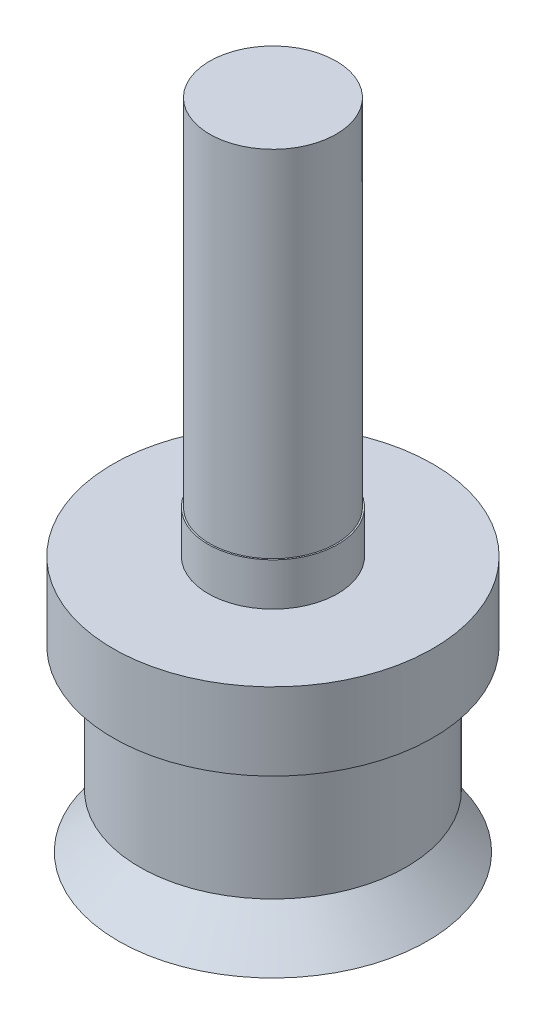
ISO-10303-21;
HEADER;
FILE_DESCRIPTION(('STEP AP214'),'2;1');
FILE_NAME('part.step','',(''),(''),'','','');
FILE_SCHEMA(('AUTOMOTIVE_DESIGN { 1 0 10303 214 1 1 1 1 }'));
ENDSEC;
DATA;
#1=APPLICATION_CONTEXT('core data for automotive mechanical design processes');
#2=APPLICATION_PROTOCOL_DEFINITION('international standard','automotive_design',2000,#1);
#3=PRODUCT_CONTEXT('',#1,'mechanical');
#4=PRODUCT('Part','Part','',(#3));
#5=PRODUCT_RELATED_PRODUCT_CATEGORY('part','',(#4));
#6=PRODUCT_DEFINITION_FORMATION('','',#4);
#7=PRODUCT_DEFINITION_CONTEXT('part definition',#1,'design');
#8=PRODUCT_DEFINITION('design','',#6,#7);
#9=PRODUCT_DEFINITION_SHAPE('','',#8);
#10=(LENGTH_UNIT() NAMED_UNIT(*) SI_UNIT(.MILLI.,.METRE.));
#11=(NAMED_UNIT(*) PLANE_ANGLE_UNIT() SI_UNIT($,.RADIAN.));
#12=(NAMED_UNIT(*) SI_UNIT($,.STERADIAN.) SOLID_ANGLE_UNIT());
#13=UNCERTAINTY_MEASURE_WITH_UNIT(LENGTH_MEASURE(1.E-05),#10,'distance_accuracy_value','');
#14=(GEOMETRIC_REPRESENTATION_CONTEXT(3) GLOBAL_UNCERTAINTY_ASSIGNED_CONTEXT((#13)) GLOBAL_UNIT_ASSIGNED_CONTEXT((#10,
#11,#12)) REPRESENTATION_CONTEXT('',''));
#15=CARTESIAN_POINT('',(0.,0.,0.));
#16=DIRECTION('',(0.,0.,1.));
#17=DIRECTION('',(1.,0.,0.));
#18=AXIS2_PLACEMENT_3D('',#15,#16,#17);
#19=CARTESIAN_POINT('',(0.,14.9,0.));
#20=DIRECTION('',(0.,-1.,0.));
#21=DIRECTION('',(0.,0.,-1.));
#22=AXIS2_PLACEMENT_3D('',#19,#20,#21);
#23=PLANE('',#22);
#24=CARTESIAN_POINT('',(0.,14.9,0.));
#25=DIRECTION('',(0.,-1.,0.));
#26=DIRECTION('',(0.,0.,-1.));
#27=AXIS2_PLACEMENT_3D('',#24,#25,#26);
#28=CIRCLE('',#27,2.375);
#29=CARTESIAN_POINT('',(0.,14.9,-2.375));
#30=VERTEX_POINT('',#29);
#31=EDGE_CURVE('E10',#30,#30,#28,.T.);
#32=ORIENTED_EDGE('',*,*,#31,.F.);
#33=EDGE_LOOP('',(#32));
#34=FACE_BOUND('',#33,.T.);
#35=ADVANCED_FACE('F37',(#34),#23,.F.);
#36=CARTESIAN_POINT('',(0.,-18.1189606466658,0.));
#37=DIRECTION('',(0.,-1.,0.));
#38=DIRECTION('',(0.,0.,-1.));
#39=AXIS2_PLACEMENT_3D('',#36,#37,#38);
#40=CYLINDRICAL_SURFACE('',#39,2.375);
#41=CARTESIAN_POINT('',(0.,1.6,0.));
#42=DIRECTION('',(0.,-1.,0.));
#43=DIRECTION('',(0.,0.,-1.));
#44=AXIS2_PLACEMENT_3D('',#41,#42,#43);
#45=CIRCLE('',#44,2.375);
#46=CARTESIAN_POINT('',(0.,1.6,-2.375));
#47=VERTEX_POINT('',#46);
#48=EDGE_CURVE('E44',#47,#47,#45,.T.);
#49=ORIENTED_EDGE('',*,*,#48,.F.);
#50=EDGE_LOOP('',(#49));
#51=FACE_BOUND('',#50,.T.);
#52=ORIENTED_EDGE('',*,*,#31,.T.);
#53=EDGE_LOOP('',(#52));
#54=FACE_BOUND('',#53,.T.);
#55=ADVANCED_FACE('F151',(#51,#54),#40,.T.);
#56=CARTESIAN_POINT('',(-2.375,1.6,0.));
#57=DIRECTION('',(0.,-1.,0.));
#58=DIRECTION('',(0.,0.,-1.));
#59=AXIS2_PLACEMENT_3D('',#56,#57,#58);
#60=PLANE('',#59);
#61=CARTESIAN_POINT('',(0.,1.6,0.));
#62=DIRECTION('',(0.,-1.,0.));
#63=DIRECTION('',(0.,0.,-1.));
#64=AXIS2_PLACEMENT_3D('',#61,#62,#63);
#65=CIRCLE('',#64,2.43);
#66=CARTESIAN_POINT('',(0.,1.6,-2.43));
#67=VERTEX_POINT('',#66);
#68=EDGE_CURVE('E49',#67,#67,#65,.T.);
#69=ORIENTED_EDGE('',*,*,#68,.F.);
#70=EDGE_LOOP('',(#69));
#71=FACE_BOUND('',#70,.T.);
#72=ORIENTED_EDGE('',*,*,#48,.T.);
#73=EDGE_LOOP('',(#72));
#74=FACE_BOUND('',#73,.T.);
#75=ADVANCED_FACE('F146',(#71,#74),#60,.F.);
#76=CARTESIAN_POINT('',(0.,-18.1189606466658,0.));
#77=DIRECTION('',(0.,-1.,0.));
#78=DIRECTION('',(0.,0.,-1.));
#79=AXIS2_PLACEMENT_3D('',#76,#77,#78);
#80=CYLINDRICAL_SURFACE('',#79,2.43);
#81=CARTESIAN_POINT('',(0.,0.,0.));
#82=DIRECTION('',(0.,-1.,0.));
#83=DIRECTION('',(0.,0.,-1.));
#84=AXIS2_PLACEMENT_3D('',#81,#82,#83);
#85=CIRCLE('',#84,2.43);
#86=CARTESIAN_POINT('',(0.,0.,-2.43));
#87=VERTEX_POINT('',#86);
#88=EDGE_CURVE('E54',#87,#87,#85,.T.);
#89=ORIENTED_EDGE('',*,*,#88,.F.);
#90=EDGE_LOOP('',(#89));
#91=FACE_BOUND('',#90,.T.);
#92=ORIENTED_EDGE('',*,*,#68,.T.);
#93=EDGE_LOOP('',(#92));
#94=FACE_BOUND('',#93,.T.);
#95=ADVANCED_FACE('F140',(#91,#94),#80,.T.);
#96=CARTESIAN_POINT('',(-2.43,0.,0.));
#97=DIRECTION('',(0.,-1.,0.));
#98=DIRECTION('',(0.,0.,-1.));
#99=AXIS2_PLACEMENT_3D('',#96,#97,#98);
#100=PLANE('',#99);
#101=CARTESIAN_POINT('',(0.,0.,0.));
#102=DIRECTION('',(0.,-1.,0.));
#103=DIRECTION('',(0.,0.,-1.));
#104=AXIS2_PLACEMENT_3D('',#101,#102,#103);
#105=CIRCLE('',#104,6.);
#106=CARTESIAN_POINT('',(0.,0.,-6.));
#107=VERTEX_POINT('',#106);
#108=EDGE_CURVE('E60',#107,#107,#105,.T.);
#109=ORIENTED_EDGE('',*,*,#108,.F.);
#110=EDGE_LOOP('',(#109));
#111=FACE_BOUND('',#110,.T.);
#112=ORIENTED_EDGE('',*,*,#88,.T.);
#113=EDGE_LOOP('',(#112));
#114=FACE_BOUND('',#113,.T.);
#115=ADVANCED_FACE('F134',(#111,#114),#100,.F.);
#116=CARTESIAN_POINT('',(0.,-18.1189606466658,0.));
#117=DIRECTION('',(0.,-1.,0.));
#118=DIRECTION('',(0.,0.,-1.));
#119=AXIS2_PLACEMENT_3D('',#116,#117,#118);
#120=CYLINDRICAL_SURFACE('',#119,6.);
#121=CARTESIAN_POINT('',(0.,-2.9,0.));
#122=DIRECTION('',(0.,-1.,0.));
#123=DIRECTION('',(0.,0.,-1.));
#124=AXIS2_PLACEMENT_3D('',#121,#122,#123);
#125=CIRCLE('',#124,6.);
#126=CARTESIAN_POINT('',(0.,-2.9,-6.));
#127=VERTEX_POINT('',#126);
#128=EDGE_CURVE('E64',#127,#127,#125,.T.);
#129=ORIENTED_EDGE('',*,*,#128,.F.);
#130=EDGE_LOOP('',(#129));
#131=FACE_BOUND('',#130,.T.);
#132=ORIENTED_EDGE('',*,*,#108,.T.);
#133=EDGE_LOOP('',(#132));
#134=FACE_BOUND('',#133,.T.);
#135=ADVANCED_FACE('F128',(#131,#134),#120,.T.);
#136=CARTESIAN_POINT('',(-6.,-2.9,0.));
#137=DIRECTION('',(0.,1.,0.));
#138=DIRECTION('',(0.,0.,1.));
#139=AXIS2_PLACEMENT_3D('',#136,#137,#138);
#140=PLANE('',#139);
#141=CARTESIAN_POINT('',(0.,-2.9,0.));
#142=DIRECTION('',(0.,-1.,0.));
#143=DIRECTION('',(0.,0.,-1.));
#144=AXIS2_PLACEMENT_3D('',#141,#142,#143);
#145=CIRCLE('',#144,5.);
#146=CARTESIAN_POINT('',(0.,-2.9,-5.));
#147=VERTEX_POINT('',#146);
#148=EDGE_CURVE('E68',#147,#147,#145,.T.);
#149=ORIENTED_EDGE('',*,*,#148,.F.);
#150=EDGE_LOOP('',(#149));
#151=FACE_BOUND('',#150,.T.);
#152=ORIENTED_EDGE('',*,*,#128,.T.);
#153=EDGE_LOOP('',(#152));
#154=FACE_BOUND('',#153,.T.);
#155=ADVANCED_FACE('F122',(#151,#154),#140,.F.);
#156=CARTESIAN_POINT('',(0.,-18.1189606466658,0.));
#157=DIRECTION('',(0.,-1.,0.));
#158=DIRECTION('',(0.,0.,-1.));
#159=AXIS2_PLACEMENT_3D('',#156,#157,#158);
#160=CYLINDRICAL_SURFACE('',#159,5.);
#161=CARTESIAN_POINT('',(0.,-7.6,0.));
#162=DIRECTION('',(0.,-1.,0.));
#163=DIRECTION('',(0.,0.,-1.));
#164=AXIS2_PLACEMENT_3D('',#161,#162,#163);
#165=CIRCLE('',#164,5.);
#166=CARTESIAN_POINT('',(0.,-7.6,-5.));
#167=VERTEX_POINT('',#166);
#168=EDGE_CURVE('E72',#167,#167,#165,.T.);
#169=ORIENTED_EDGE('',*,*,#168,.F.);
#170=EDGE_LOOP('',(#169));
#171=FACE_BOUND('',#170,.T.);
#172=ORIENTED_EDGE('',*,*,#148,.T.);
#173=EDGE_LOOP('',(#172));
#174=FACE_BOUND('',#173,.T.);
#175=ADVANCED_FACE('F116',(#171,#174),#160,.T.);
#176=CARTESIAN_POINT('',(-5.,-7.6,0.));
#177=DIRECTION('',(0.,1.,0.));
#178=DIRECTION('',(0.,0.,1.));
#179=AXIS2_PLACEMENT_3D('',#176,#177,#178);
#180=PLANE('',#179);
#181=CARTESIAN_POINT('',(0.,-7.6,0.));
#182=DIRECTION('',(0.,-1.,0.));
#183=DIRECTION('',(0.,0.,-1.));
#184=AXIS2_PLACEMENT_3D('',#181,#182,#183);
#185=CIRCLE('',#184,3.5);
#186=CARTESIAN_POINT('',(0.,-7.6,-3.5));
#187=VERTEX_POINT('',#186);
#188=EDGE_CURVE('E76',#187,#187,#185,.T.);
#189=ORIENTED_EDGE('',*,*,#188,.F.);
#190=EDGE_LOOP('',(#189));
#191=FACE_BOUND('',#190,.T.);
#192=ORIENTED_EDGE('',*,*,#168,.T.);
#193=EDGE_LOOP('',(#192));
#194=FACE_BOUND('',#193,.T.);
#195=ADVANCED_FACE('F110',(#191,#194),#180,.F.);
#196=CARTESIAN_POINT('',(0.,-7.6,0.));
#197=DIRECTION('',(0.,-1.,0.));
#198=DIRECTION('',(0.,0.,-1.));
#199=AXIS2_PLACEMENT_3D('',#196,#197,#198);
#200=CONICAL_SURFACE('',#199,3.5,0.855052737126016);
#201=CARTESIAN_POINT('',(0.,-9.6,0.));
#202=DIRECTION('',(0.,-1.,0.));
#203=DIRECTION('',(0.,0.,-1.));
#204=AXIS2_PLACEMENT_3D('',#201,#202,#203);
#205=CIRCLE('',#204,5.8);
#206=CARTESIAN_POINT('',(0.,-9.6,-5.8));
#207=VERTEX_POINT('',#206);
#208=EDGE_CURVE('E80',#207,#207,#205,.T.);
#209=ORIENTED_EDGE('',*,*,#208,.F.);
#210=EDGE_LOOP('',(#209));
#211=FACE_BOUND('',#210,.T.);
#212=ORIENTED_EDGE('',*,*,#188,.T.);
#213=EDGE_LOOP('',(#212));
#214=FACE_BOUND('',#213,.T.);
#215=ADVANCED_FACE('F104',(#211,#214),#200,.T.);
#216=CARTESIAN_POINT('',(-5.8,-9.6,0.));
#217=DIRECTION('',(0.,1.,0.));
#218=DIRECTION('',(0.,0.,1.));
#219=AXIS2_PLACEMENT_3D('',#216,#217,#218);
#220=PLANE('',#219);
#221=CARTESIAN_POINT('',(0.,-9.6,0.));
#222=DIRECTION('',(0.,-1.,0.));
#223=DIRECTION('',(0.,0.,-1.));
#224=AXIS2_PLACEMENT_3D('',#221,#222,#223);
#225=CIRCLE('',#224,1.5);
#226=CARTESIAN_POINT('',(0.,-9.6,-1.5));
#227=VERTEX_POINT('',#226);
#228=EDGE_CURVE('E84',#227,#227,#225,.T.);
#229=ORIENTED_EDGE('',*,*,#228,.F.);
#230=EDGE_LOOP('',(#229));
#231=FACE_BOUND('',#230,.T.);
#232=ORIENTED_EDGE('',*,*,#208,.T.);
#233=EDGE_LOOP('',(#232));
#234=FACE_BOUND('',#233,.T.);
#235=ADVANCED_FACE('F98',(#231,#234),#220,.F.);
#236=CARTESIAN_POINT('',(0.,-18.1189606466658,0.));
#237=DIRECTION('',(0.,-1.,0.));
#238=DIRECTION('',(0.,0.,-1.));
#239=AXIS2_PLACEMENT_3D('',#236,#237,#238);
#240=CYLINDRICAL_SURFACE('',#239,1.5);
#241=CARTESIAN_POINT('',(0.,2.4,0.));
#242=DIRECTION('',(0.,-1.,0.));
#243=DIRECTION('',(0.,0.,-1.));
#244=AXIS2_PLACEMENT_3D('',#241,#242,#243);
#245=CIRCLE('',#244,1.5);
#246=CARTESIAN_POINT('',(0.,2.4,-1.5));
#247=VERTEX_POINT('',#246);
#248=EDGE_CURVE('E88',#247,#247,#245,.T.);
#249=ORIENTED_EDGE('',*,*,#248,.F.);
#250=EDGE_LOOP('',(#249));
#251=FACE_BOUND('',#250,.T.);
#252=ORIENTED_EDGE('',*,*,#228,.T.);
#253=EDGE_LOOP('',(#252));
#254=FACE_BOUND('',#253,.T.);
#255=ADVANCED_FACE('F95',(#251,#254),#240,.F.);
#256=CARTESIAN_POINT('',(-1.5,2.4,0.));
#257=DIRECTION('',(0.,1.,0.));
#258=DIRECTION('',(0.,0.,1.));
#259=AXIS2_PLACEMENT_3D('',#256,#257,#258);
#260=PLANE('',#259);
#261=ORIENTED_EDGE('',*,*,#248,.T.);
#262=EDGE_LOOP('',(#261));
#263=FACE_BOUND('',#262,.T.);
#264=ADVANCED_FACE('F93',(#263),#260,.F.);
#265=CLOSED_SHELL('',(#35,#55,#75,#95,#115,#135,#155,#175,#195,#215,#235,#255,#264));
#266=MANIFOLD_SOLID_BREP('B2',#265);
#267=ADVANCED_BREP_SHAPE_REPRESENTATION('',(#18,#266),#14);
#268=SHAPE_DEFINITION_REPRESENTATION(#9,#267);
ENDSEC;
END-ISO-10303-21;
